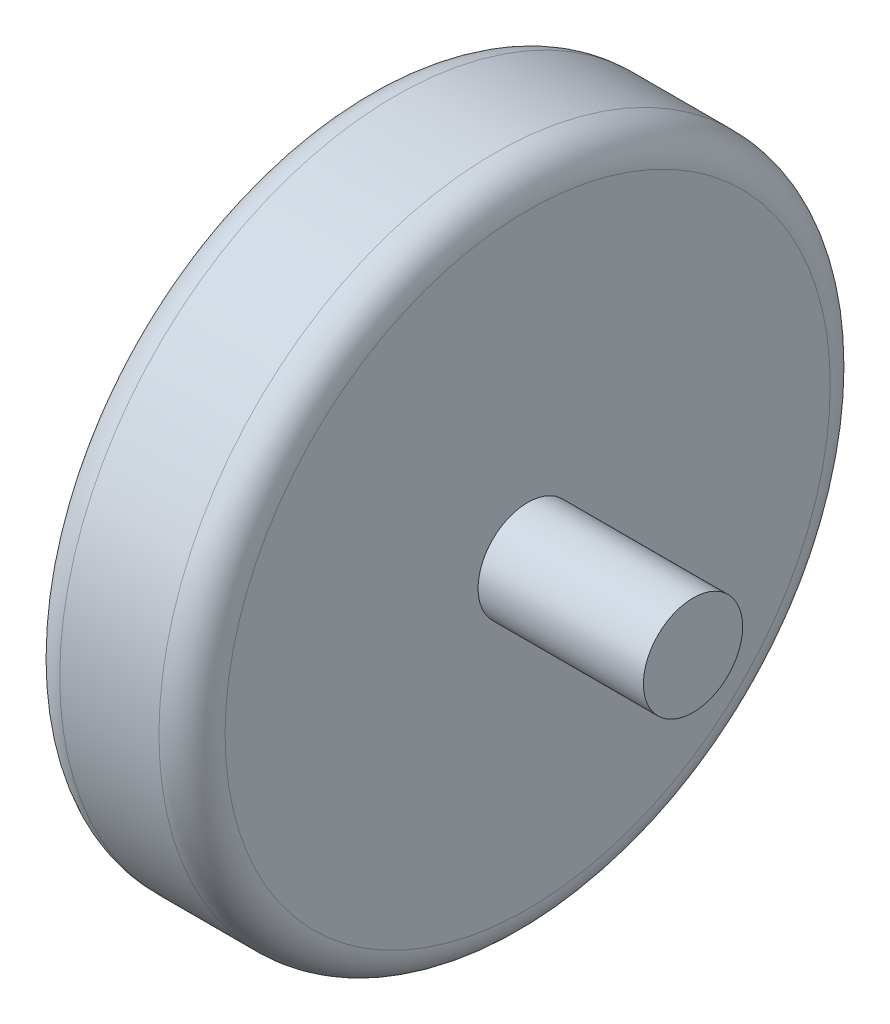
ISO-10303-21;
HEADER;
FILE_DESCRIPTION(('STEP AP214'),'2;1');
FILE_NAME('part.step','',(''),(''),'','','');
FILE_SCHEMA(('AUTOMOTIVE_DESIGN { 1 0 10303 214 1 1 1 1 }'));
ENDSEC;
DATA;
#1=APPLICATION_CONTEXT('core data for automotive mechanical design processes');
#2=APPLICATION_PROTOCOL_DEFINITION('international standard','automotive_design',2000,#1);
#3=PRODUCT_CONTEXT('',#1,'mechanical');
#4=PRODUCT('Part','Part','',(#3));
#5=PRODUCT_RELATED_PRODUCT_CATEGORY('part','',(#4));
#6=PRODUCT_DEFINITION_FORMATION('','',#4);
#7=PRODUCT_DEFINITION_CONTEXT('part definition',#1,'design');
#8=PRODUCT_DEFINITION('design','',#6,#7);
#9=PRODUCT_DEFINITION_SHAPE('','',#8);
#10=(LENGTH_UNIT() NAMED_UNIT(*) SI_UNIT(.MILLI.,.METRE.));
#11=(NAMED_UNIT(*) PLANE_ANGLE_UNIT() SI_UNIT($,.RADIAN.));
#12=(NAMED_UNIT(*) SI_UNIT($,.STERADIAN.) SOLID_ANGLE_UNIT());
#13=UNCERTAINTY_MEASURE_WITH_UNIT(LENGTH_MEASURE(1.E-05),#10,'distance_accuracy_value','');
#14=(GEOMETRIC_REPRESENTATION_CONTEXT(3) GLOBAL_UNCERTAINTY_ASSIGNED_CONTEXT((#13)) GLOBAL_UNIT_ASSIGNED_CONTEXT((#10,
#11,#12)) REPRESENTATION_CONTEXT('',''));
#15=CARTESIAN_POINT('',(0.,0.,0.));
#16=DIRECTION('',(0.,0.,1.));
#17=DIRECTION('',(1.,0.,0.));
#18=AXIS2_PLACEMENT_3D('',#15,#16,#17);
#19=CARTESIAN_POINT('',(950.,-838.535384937276,-147.489609775728));
#20=DIRECTION('',(1.,0.,0.));
#21=DIRECTION('',(0.,0.,-1.));
#22=AXIS2_PLACEMENT_3D('',#19,#20,#21);
#23=PLANE('',#22);
#24=CARTESIAN_POINT('',(950.,-838.535384937276,-147.489609775728));
#25=DIRECTION('',(1.,0.,0.));
#26=DIRECTION('',(0.,0.,-1.));
#27=AXIS2_PLACEMENT_3D('',#24,#25,#26);
#28=CIRCLE('',#27,15.);
#29=CARTESIAN_POINT('',(950.,-838.535384937276,-162.489609775728));
#30=VERTEX_POINT('',#29);
#31=EDGE_CURVE('E18',#30,#30,#28,.T.);
#32=ORIENTED_EDGE('',*,*,#31,.F.);
#33=EDGE_LOOP('',(#32));
#34=FACE_BOUND('',#33,.T.);
#35=ADVANCED_FACE('F15',(#34),#23,.F.);
#36=CARTESIAN_POINT('',(500.,-838.535384937276,-147.489609775728));
#37=DIRECTION('',(1.,0.,0.));
#38=DIRECTION('',(0.,0.,-1.));
#39=AXIS2_PLACEMENT_3D('',#36,#37,#38);
#40=CYLINDRICAL_SURFACE('',#39,15.);
#41=CARTESIAN_POINT('',(1000.,-838.535384937276,-147.489609775728));
#42=DIRECTION('',(1.,0.,0.));
#43=DIRECTION('',(0.,0.,-1.));
#44=AXIS2_PLACEMENT_3D('',#41,#42,#43);
#45=CIRCLE('',#44,15.);
#46=CARTESIAN_POINT('',(1000.,-838.535384937276,-162.489609775728));
#47=VERTEX_POINT('',#46);
#48=EDGE_CURVE('E36',#47,#47,#45,.F.);
#49=ORIENTED_EDGE('',*,*,#48,.T.);
#50=EDGE_LOOP('',(#49));
#51=FACE_BOUND('',#50,.T.);
#52=ORIENTED_EDGE('',*,*,#31,.T.);
#53=EDGE_LOOP('',(#52));
#54=FACE_BOUND('',#53,.T.);
#55=ADVANCED_FACE('F46',(#51,#54),#40,.T.);
#56=CARTESIAN_POINT('',(1000.,-838.535384937276,-147.489609775728));
#57=DIRECTION('',(1.,0.,0.));
#58=DIRECTION('',(0.,0.,-1.));
#59=AXIS2_PLACEMENT_3D('',#56,#57,#58);
#60=PLANE('',#59);
#61=ORIENTED_EDGE('',*,*,#48,.F.);
#62=EDGE_LOOP('',(#61));
#63=FACE_BOUND('',#62,.T.);
#64=CARTESIAN_POINT('',(1000.,-838.535384937276,-147.489609775728));
#65=DIRECTION('',(1.,0.,0.));
#66=DIRECTION('',(0.,0.,1.));
#67=AXIS2_PLACEMENT_3D('',#64,#65,#66);
#68=CIRCLE('',#67,91.5000000000003);
#69=CARTESIAN_POINT('',(1000.,-838.535384937276,-55.9896097757277));
#70=VERTEX_POINT('',#69);
#71=EDGE_CURVE('E38',#70,#70,#68,.T.);
#72=ORIENTED_EDGE('',*,*,#71,.F.);
#73=EDGE_LOOP('',(#72));
#74=FACE_BOUND('',#73,.T.);
#75=ADVANCED_FACE('F53',(#63,#74),#60,.F.);
#76=CARTESIAN_POINT('',(1010.,-838.535384937276,-147.489609775728));
#77=DIRECTION('',(1.,0.,0.));
#78=DIRECTION('',(0.,0.,-1.));
#79=AXIS2_PLACEMENT_3D('',#76,#77,#78);
#80=TOROIDAL_SURFACE('',#79,91.5,10.);
#81=CARTESIAN_POINT('',(1010.,-838.535384937276,-147.489609775728));
#82=DIRECTION('',(1.,0.,0.));
#83=DIRECTION('',(0.,0.,-1.));
#84=AXIS2_PLACEMENT_3D('',#81,#82,#83);
#85=CIRCLE('',#84,101.5);
#86=CARTESIAN_POINT('',(1010.,-838.535384937276,-248.989609775728));
#87=VERTEX_POINT('',#86);
#88=EDGE_CURVE('E42',#87,#87,#85,.T.);
#89=ORIENTED_EDGE('',*,*,#88,.F.);
#90=EDGE_LOOP('',(#89));
#91=FACE_BOUND('',#90,.T.);
#92=ORIENTED_EDGE('',*,*,#71,.T.);
#93=EDGE_LOOP('',(#92));
#94=FACE_BOUND('',#93,.T.);
#95=ADVANCED_FACE('F105',(#91,#94),#80,.T.);
#96=CARTESIAN_POINT('',(1000.,-838.535384937276,-147.489609775728));
#97=DIRECTION('',(1.,0.,0.));
#98=DIRECTION('',(0.,0.,-1.));
#99=AXIS2_PLACEMENT_3D('',#96,#97,#98);
#100=CYLINDRICAL_SURFACE('',#99,101.5);
#101=ORIENTED_EDGE('',*,*,#88,.T.);
#102=EDGE_LOOP('',(#101));
#103=FACE_BOUND('',#102,.T.);
#104=CARTESIAN_POINT('',(1040.,-838.535384937276,-147.489609775728));
#105=DIRECTION('',(1.,0.,0.));
#106=DIRECTION('',(0.,0.,-1.));
#107=AXIS2_PLACEMENT_3D('',#104,#105,#106);
#108=CIRCLE('',#107,101.5);
#109=CARTESIAN_POINT('',(1040.,-838.535384937276,-248.989609775728));
#110=VERTEX_POINT('',#109);
#111=EDGE_CURVE('E35',#110,#110,#108,.T.);
#112=ORIENTED_EDGE('',*,*,#111,.F.);
#113=EDGE_LOOP('',(#112));
#114=FACE_BOUND('',#113,.T.);
#115=ADVANCED_FACE('F109',(#103,#114),#100,.T.);
#116=CARTESIAN_POINT('',(1100.,-838.535384937276,-147.489609775728));
#117=DIRECTION('',(1.,0.,0.));
#118=DIRECTION('',(0.,0.,-1.));
#119=AXIS2_PLACEMENT_3D('',#116,#117,#118);
#120=PLANE('',#119);
#121=CARTESIAN_POINT('',(1100.,-838.535384937276,-147.489609775728));
#122=DIRECTION('',(1.,0.,0.));
#123=DIRECTION('',(0.,0.,-1.));
#124=AXIS2_PLACEMENT_3D('',#121,#122,#123);
#125=CIRCLE('',#124,15.);
#126=CARTESIAN_POINT('',(1100.,-838.535384937276,-162.489609775728));
#127=VERTEX_POINT('',#126);
#128=EDGE_CURVE('E27',#127,#127,#125,.F.);
#129=ORIENTED_EDGE('',*,*,#128,.F.);
#130=EDGE_LOOP('',(#129));
#131=FACE_BOUND('',#130,.T.);
#132=ADVANCED_FACE('F83',(#131),#120,.T.);
#133=CARTESIAN_POINT('',(1040.,-838.535384937276,-147.489609775728));
#134=DIRECTION('',(1.,0.,0.));
#135=DIRECTION('',(0.,0.,-1.));
#136=AXIS2_PLACEMENT_3D('',#133,#134,#135);
#137=TOROIDAL_SURFACE('',#136,91.5,10.);
#138=CARTESIAN_POINT('',(1050.,-838.535384937276,-147.489609775728));
#139=DIRECTION('',(-1.,0.,0.));
#140=DIRECTION('',(0.,0.,1.));
#141=AXIS2_PLACEMENT_3D('',#138,#139,#140);
#142=CIRCLE('',#141,91.5000000000003);
#143=CARTESIAN_POINT('',(1050.,-838.535384937276,-55.9896097757277));
#144=VERTEX_POINT('',#143);
#145=EDGE_CURVE('E22',#144,#144,#142,.F.);
#146=ORIENTED_EDGE('',*,*,#145,.F.);
#147=EDGE_LOOP('',(#146));
#148=FACE_BOUND('',#147,.T.);
#149=ORIENTED_EDGE('',*,*,#111,.T.);
#150=EDGE_LOOP('',(#149));
#151=FACE_BOUND('',#150,.T.);
#152=ADVANCED_FACE('F61',(#148,#151),#137,.T.);
#153=CARTESIAN_POINT('',(500.,-838.535384937276,-147.489609775728));
#154=DIRECTION('',(1.,0.,0.));
#155=DIRECTION('',(0.,0.,-1.));
#156=AXIS2_PLACEMENT_3D('',#153,#154,#155);
#157=CYLINDRICAL_SURFACE('',#156,15.);
#158=CARTESIAN_POINT('',(1050.,-838.535384937276,-147.489609775728));
#159=DIRECTION('',(1.,0.,0.));
#160=DIRECTION('',(0.,0.,-1.));
#161=AXIS2_PLACEMENT_3D('',#158,#159,#160);
#162=CIRCLE('',#161,15.);
#163=CARTESIAN_POINT('',(1050.,-838.535384937276,-162.489609775728));
#164=VERTEX_POINT('',#163);
#165=EDGE_CURVE('E10',#164,#164,#162,.F.);
#166=ORIENTED_EDGE('',*,*,#165,.F.);
#167=EDGE_LOOP('',(#166));
#168=FACE_BOUND('',#167,.T.);
#169=ORIENTED_EDGE('',*,*,#128,.T.);
#170=EDGE_LOOP('',(#169));
#171=FACE_BOUND('',#170,.T.);
#172=ADVANCED_FACE('F56',(#168,#171),#157,.T.);
#173=CARTESIAN_POINT('',(1050.,-838.535384937276,-147.489609775728));
#174=DIRECTION('',(1.,0.,0.));
#175=DIRECTION('',(0.,0.,-1.));
#176=AXIS2_PLACEMENT_3D('',#173,#174,#175);
#177=PLANE('',#176);
#178=ORIENTED_EDGE('',*,*,#165,.T.);
#179=EDGE_LOOP('',(#178));
#180=FACE_BOUND('',#179,.T.);
#181=ORIENTED_EDGE('',*,*,#145,.T.);
#182=EDGE_LOOP('',(#181));
#183=FACE_BOUND('',#182,.T.);
#184=ADVANCED_FACE('F54',(#180,#183),#177,.T.);
#185=CLOSED_SHELL('',(#35,#55,#75,#95,#115,#132,#152,#172,#184));
#186=MANIFOLD_SOLID_BREP('B1',#185);
#187=ADVANCED_BREP_SHAPE_REPRESENTATION('',(#18,#186),#14);
#188=SHAPE_DEFINITION_REPRESENTATION(#9,#187);
ENDSEC;
END-ISO-10303-21;
